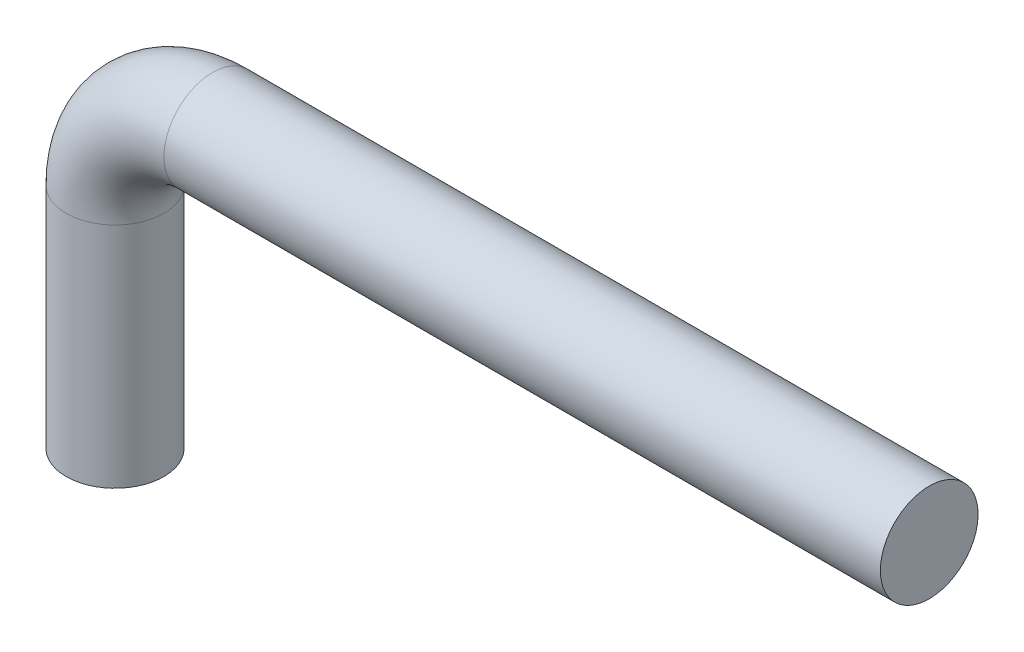
ISO-10303-21;
HEADER;
FILE_DESCRIPTION(('STEP AP214'),'2;1');
FILE_NAME('part.step','',(''),(''),'','','');
FILE_SCHEMA(('AUTOMOTIVE_DESIGN { 1 0 10303 214 1 1 1 1 }'));
ENDSEC;
DATA;
#1=APPLICATION_CONTEXT('core data for automotive mechanical design processes');
#2=APPLICATION_PROTOCOL_DEFINITION('international standard','automotive_design',2000,#1);
#3=PRODUCT_CONTEXT('',#1,'mechanical');
#4=PRODUCT('Part','Part','',(#3));
#5=PRODUCT_RELATED_PRODUCT_CATEGORY('part','',(#4));
#6=PRODUCT_DEFINITION_FORMATION('','',#4);
#7=PRODUCT_DEFINITION_CONTEXT('part definition',#1,'design');
#8=PRODUCT_DEFINITION('design','',#6,#7);
#9=PRODUCT_DEFINITION_SHAPE('','',#8);
#10=(LENGTH_UNIT() NAMED_UNIT(*) SI_UNIT(.MILLI.,.METRE.));
#11=(NAMED_UNIT(*) PLANE_ANGLE_UNIT() SI_UNIT($,.RADIAN.));
#12=(NAMED_UNIT(*) SI_UNIT($,.STERADIAN.) SOLID_ANGLE_UNIT());
#13=UNCERTAINTY_MEASURE_WITH_UNIT(LENGTH_MEASURE(1.E-05),#10,'distance_accuracy_value','');
#14=(GEOMETRIC_REPRESENTATION_CONTEXT(3) GLOBAL_UNCERTAINTY_ASSIGNED_CONTEXT((#13)) GLOBAL_UNIT_ASSIGNED_CONTEXT((#10,
#11,#12)) REPRESENTATION_CONTEXT('',''));
#15=CARTESIAN_POINT('',(0.,0.,0.));
#16=DIRECTION('',(0.,0.,1.));
#17=DIRECTION('',(1.,0.,0.));
#18=AXIS2_PLACEMENT_3D('',#15,#16,#17);
#19=CARTESIAN_POINT('',(42.1926910299004,25.9485049833887,0.));
#20=DIRECTION('',(1.,0.,0.));
#21=DIRECTION('',(0.,0.,1.));
#22=AXIS2_PLACEMENT_3D('',#19,#20,#21);
#23=PLANE('',#22);
#24=CARTESIAN_POINT('',(42.1926910299004,25.9485049833887,0.));
#25=DIRECTION('',(1.,0.,0.));
#26=DIRECTION('',(0.,0.,1.));
#27=AXIS2_PLACEMENT_3D('',#24,#25,#26);
#28=CIRCLE('',#27,3.81);
#29=CARTESIAN_POINT('',(42.1926910299004,25.9485049833887,3.81));
#30=VERTEX_POINT('',#29);
#31=EDGE_CURVE('E61',#30,#30,#28,.T.);
#32=ORIENTED_EDGE('',*,*,#31,.T.);
#33=EDGE_LOOP('',(#32));
#34=FACE_BOUND('',#33,.T.);
#35=ADVANCED_FACE('F47',(#34),#23,.T.);
#36=CARTESIAN_POINT('',(-21.3073089700996,0.548504983388706,0.));
#37=DIRECTION('',(0.,1.,0.));
#38=DIRECTION('',(0.,0.,1.));
#39=AXIS2_PLACEMENT_3D('',#36,#37,#38);
#40=PLANE('',#39);
#41=CARTESIAN_POINT('',(-21.3073089700996,0.548504983388706,0.));
#42=DIRECTION('',(0.,1.,0.));
#43=DIRECTION('',(0.,0.,1.));
#44=AXIS2_PLACEMENT_3D('',#41,#42,#43);
#45=CIRCLE('',#44,3.81);
#46=CARTESIAN_POINT('',(-21.3073089700996,0.548504983388706,3.81));
#47=VERTEX_POINT('',#46);
#48=EDGE_CURVE('E11',#47,#47,#45,.T.);
#49=ORIENTED_EDGE('',*,*,#48,.F.);
#50=EDGE_LOOP('',(#49));
#51=FACE_BOUND('',#50,.T.);
#52=ADVANCED_FACE('F71',(#51),#40,.F.);
#53=CARTESIAN_POINT('',(42.1926910299004,25.9485049833887,0.));
#54=DIRECTION('',(-1.,0.,0.));
#55=DIRECTION('',(0.,0.,1.));
#56=AXIS2_PLACEMENT_3D('',#53,#54,#55);
#57=CYLINDRICAL_SURFACE('',#56,3.81);
#58=CARTESIAN_POINT('',(-13.6873089700996,25.9485049833887,0.));
#59=DIRECTION('',(1.,0.,0.));
#60=DIRECTION('',(0.,0.,1.));
#61=AXIS2_PLACEMENT_3D('',#58,#59,#60);
#62=CIRCLE('',#61,3.81);
#63=CARTESIAN_POINT('',(-13.6873089700996,29.7585049833887,0.));
#64=VERTEX_POINT('',#63);
#65=EDGE_CURVE('E57',#64,#64,#62,.T.);
#66=ORIENTED_EDGE('',*,*,#65,.T.);
#67=EDGE_LOOP('',(#66));
#68=FACE_BOUND('',#67,.T.);
#69=ORIENTED_EDGE('',*,*,#31,.F.);
#70=EDGE_LOOP('',(#69));
#71=FACE_BOUND('',#70,.T.);
#72=ADVANCED_FACE('F68',(#68,#71),#57,.T.);
#73=CARTESIAN_POINT('',(-13.6873089700997,18.3285049833887,0.));
#74=DIRECTION('',(0.,0.,1.));
#75=DIRECTION('',(1.,0.,0.));
#76=AXIS2_PLACEMENT_3D('',#73,#74,#75);
#77=TOROIDAL_SURFACE('',#76,7.62,3.81);
#78=CARTESIAN_POINT('',(-21.3073089700996,18.3285049833887,0.));
#79=DIRECTION('',(0.,1.,0.));
#80=DIRECTION('',(0.,0.,1.));
#81=AXIS2_PLACEMENT_3D('',#78,#79,#80);
#82=CIRCLE('',#81,3.81);
#83=CARTESIAN_POINT('',(-25.1173089700996,18.3285049833887,0.));
#84=VERTEX_POINT('',#83);
#85=EDGE_CURVE('E53',#84,#84,#82,.T.);
#86=CARTESIAN_POINT('',(-13.6873089700997,18.3285049833887,0.));
#87=DIRECTION('',(0.,0.,1.));
#88=DIRECTION('',(1.,0.,0.));
#89=AXIS2_PLACEMENT_3D('',#86,#87,#88);
#90=CIRCLE('',#89,11.43);
#91=EDGE_CURVE('',#64,#84,#90,.T.);
#92=ORIENTED_EDGE('',*,*,#65,.F.);
#93=ORIENTED_EDGE('',*,*,#85,.T.);
#94=ORIENTED_EDGE('',*,*,#91,.T.);
#95=ORIENTED_EDGE('',*,*,#91,.F.);
#96=EDGE_LOOP('',(#92,#94,#93,#95));
#97=FACE_BOUND('',#96,.T.);
#98=ADVANCED_FACE('F70',(#97),#77,.T.);
#99=CARTESIAN_POINT('',(-21.3073089700996,18.3285049833887,0.));
#100=DIRECTION('',(0.,-1.,0.));
#101=DIRECTION('',(1.,0.,0.));
#102=AXIS2_PLACEMENT_3D('',#99,#100,#101);
#103=CYLINDRICAL_SURFACE('',#102,3.81);
#104=ORIENTED_EDGE('',*,*,#48,.T.);
#105=EDGE_LOOP('',(#104));
#106=FACE_BOUND('',#105,.T.);
#107=ORIENTED_EDGE('',*,*,#85,.F.);
#108=EDGE_LOOP('',(#107));
#109=FACE_BOUND('',#108,.T.);
#110=ADVANCED_FACE('F78',(#106,#109),#103,.T.);
#111=CLOSED_SHELL('',(#35,#52,#72,#98,#110));
#112=MANIFOLD_SOLID_BREP('B2',#111);
#113=ADVANCED_BREP_SHAPE_REPRESENTATION('',(#18,#112),#14);
#114=SHAPE_DEFINITION_REPRESENTATION(#9,#113);
ENDSEC;
END-ISO-10303-21;
